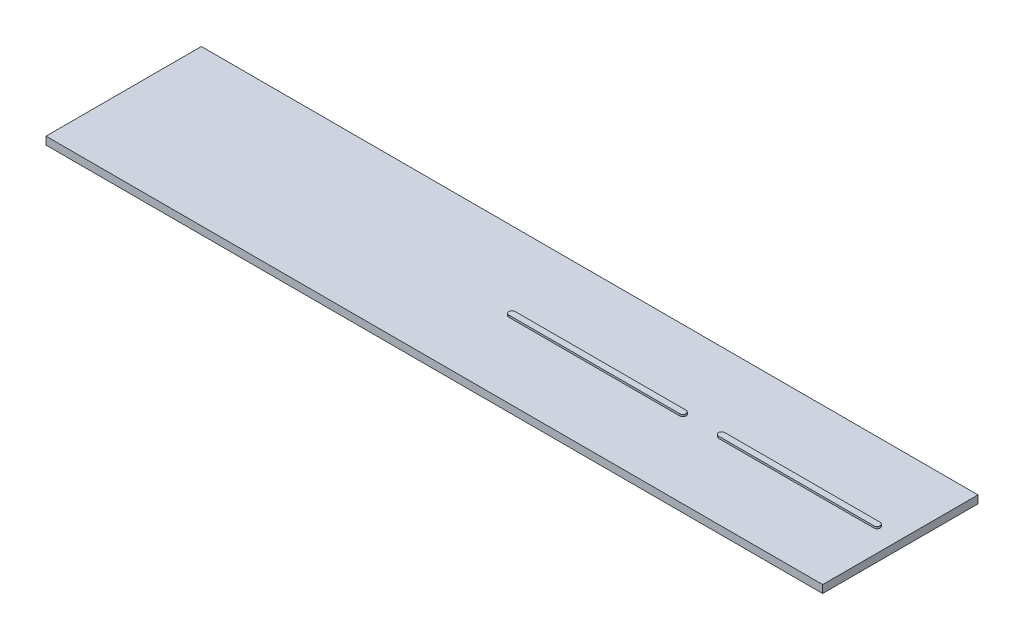
ISO-10303-21;
HEADER;
FILE_DESCRIPTION(('STEP AP214'),'2;1');
FILE_NAME('part.step','',(''),(''),'','','');
FILE_SCHEMA(('AUTOMOTIVE_DESIGN { 1 0 10303 214 1 1 1 1 }'));
ENDSEC;
DATA;
#1=APPLICATION_CONTEXT('core data for automotive mechanical design processes');
#2=APPLICATION_PROTOCOL_DEFINITION('international standard','automotive_design',2000,#1);
#3=PRODUCT_CONTEXT('',#1,'mechanical');
#4=PRODUCT('Part','Part','',(#3));
#5=PRODUCT_RELATED_PRODUCT_CATEGORY('part','',(#4));
#6=PRODUCT_DEFINITION_FORMATION('','',#4);
#7=PRODUCT_DEFINITION_CONTEXT('part definition',#1,'design');
#8=PRODUCT_DEFINITION('design','',#6,#7);
#9=PRODUCT_DEFINITION_SHAPE('','',#8);
#10=(LENGTH_UNIT() NAMED_UNIT(*) SI_UNIT(.MILLI.,.METRE.));
#11=(NAMED_UNIT(*) PLANE_ANGLE_UNIT() SI_UNIT($,.RADIAN.));
#12=(NAMED_UNIT(*) SI_UNIT($,.STERADIAN.) SOLID_ANGLE_UNIT());
#13=UNCERTAINTY_MEASURE_WITH_UNIT(LENGTH_MEASURE(1.E-05),#10,'distance_accuracy_value','');
#14=(GEOMETRIC_REPRESENTATION_CONTEXT(3) GLOBAL_UNCERTAINTY_ASSIGNED_CONTEXT((#13)) GLOBAL_UNIT_ASSIGNED_CONTEXT((#10,
#11,#12)) REPRESENTATION_CONTEXT('',''));
#15=CARTESIAN_POINT('',(0.,0.,0.));
#16=DIRECTION('',(0.,0.,1.));
#17=DIRECTION('',(1.,0.,0.));
#18=AXIS2_PLACEMENT_3D('',#15,#16,#17);
#19=CARTESIAN_POINT('',(0.,0.,0.));
#20=DIRECTION('',(0.,1.,0.));
#21=DIRECTION('',(0.,0.,1.));
#22=AXIS2_PLACEMENT_3D('',#19,#20,#21);
#23=PLANE('',#22);
#24=DIRECTION('',(0.,0.,1.));
#25=VECTOR('',#24,1.);
#26=CARTESIAN_POINT('',(-50000.,0.,-10000.));
#27=LINE('',#26,#25);
#28=CARTESIAN_POINT('',(-50000.,0.,-10000.));
#29=VERTEX_POINT('',#28);
#30=CARTESIAN_POINT('',(-50000.,0.,10000.));
#31=VERTEX_POINT('',#30);
#32=EDGE_CURVE('E203',#29,#31,#27,.T.);
#33=ORIENTED_EDGE('',*,*,#32,.T.);
#34=DIRECTION('',(1.,0.,0.));
#35=VECTOR('',#34,1.);
#36=CARTESIAN_POINT('',(-50000.,0.,10000.));
#37=LINE('',#36,#35);
#38=CARTESIAN_POINT('',(50000.,0.,10000.));
#39=VERTEX_POINT('',#38);
#40=EDGE_CURVE('E224',#31,#39,#37,.T.);
#41=ORIENTED_EDGE('',*,*,#40,.T.);
#42=DIRECTION('',(0.,0.,-1.));
#43=VECTOR('',#42,1.);
#44=CARTESIAN_POINT('',(50000.,0.,-10000.));
#45=LINE('',#44,#43);
#46=CARTESIAN_POINT('',(50000.,0.,-10000.));
#47=VERTEX_POINT('',#46);
#48=EDGE_CURVE('E228',#39,#47,#45,.T.);
#49=ORIENTED_EDGE('',*,*,#48,.T.);
#50=DIRECTION('',(-1.,0.,0.));
#51=VECTOR('',#50,1.);
#52=CARTESIAN_POINT('',(-50000.,0.,-10000.));
#53=LINE('',#52,#51);
#54=EDGE_CURVE('E209',#47,#29,#53,.T.);
#55=ORIENTED_EDGE('',*,*,#54,.T.);
#56=EDGE_LOOP('',(#33,#41,#49,#55));
#57=FACE_BOUND('',#56,.T.);
#58=DIRECTION('',(-1.,0.,0.));
#59=VECTOR('',#58,1.);
#60=CARTESIAN_POINT('',(47000.,0.,-400.));
#61=LINE('',#60,#59);
#62=CARTESIAN_POINT('',(47000.,0.,-400.));
#63=VERTEX_POINT('',#62);
#64=CARTESIAN_POINT('',(27000.,0.,-399.999999999997));
#65=VERTEX_POINT('',#64);
#66=EDGE_CURVE('E164',#63,#65,#61,.T.);
#67=ORIENTED_EDGE('',*,*,#66,.F.);
#68=CARTESIAN_POINT('',(47000.,0.,1.11022302462516E-13));
#69=DIRECTION('',(0.,1.,0.));
#70=DIRECTION('',(0.,0.,1.));
#71=AXIS2_PLACEMENT_3D('',#68,#69,#70);
#72=CIRCLE('',#71,400.);
#73=CARTESIAN_POINT('',(47000.,0.,400.));
#74=VERTEX_POINT('',#73);
#75=EDGE_CURVE('E159',#74,#63,#72,.T.);
#76=ORIENTED_EDGE('',*,*,#75,.F.);
#77=DIRECTION('',(1.,0.,0.));
#78=VECTOR('',#77,1.);
#79=CARTESIAN_POINT('',(47000.,0.,400.));
#80=LINE('',#79,#78);
#81=CARTESIAN_POINT('',(27000.,0.,400.000000000003));
#82=VERTEX_POINT('',#81);
#83=EDGE_CURVE('E174',#82,#74,#80,.T.);
#84=ORIENTED_EDGE('',*,*,#83,.F.);
#85=CARTESIAN_POINT('',(27000.,0.,2.5661396353745E-12));
#86=DIRECTION('',(0.,1.,0.));
#87=DIRECTION('',(0.,0.,1.));
#88=AXIS2_PLACEMENT_3D('',#85,#86,#87);
#89=CIRCLE('',#88,400.);
#90=EDGE_CURVE('E186',#65,#82,#89,.T.);
#91=ORIENTED_EDGE('',*,*,#90,.F.);
#92=EDGE_LOOP('',(#67,#76,#84,#91));
#93=FACE_BOUND('',#92,.T.);
#94=DIRECTION('',(1.,0.,0.));
#95=VECTOR('',#94,1.);
#96=CARTESIAN_POINT('',(0.,0.,400.));
#97=LINE('',#96,#95);
#98=CARTESIAN_POINT('',(0.,0.,400.));
#99=VERTEX_POINT('',#98);
#100=CARTESIAN_POINT('',(22000.,0.,400.));
#101=VERTEX_POINT('',#100);
#102=EDGE_CURVE('E405',#99,#101,#97,.T.);
#103=ORIENTED_EDGE('',*,*,#102,.F.);
#104=CARTESIAN_POINT('',(0.,0.,0.));
#105=DIRECTION('',(0.,1.,0.));
#106=DIRECTION('',(0.,0.,1.));
#107=AXIS2_PLACEMENT_3D('',#104,#105,#106);
#108=CIRCLE('',#107,400.);
#109=CARTESIAN_POINT('',(0.,0.,-400.));
#110=VERTEX_POINT('',#109);
#111=EDGE_CURVE('E156',#110,#99,#108,.T.);
#112=ORIENTED_EDGE('',*,*,#111,.F.);
#113=DIRECTION('',(-1.,0.,0.));
#114=VECTOR('',#113,1.);
#115=CARTESIAN_POINT('',(0.,0.,-400.));
#116=LINE('',#115,#114);
#117=CARTESIAN_POINT('',(22000.,0.,-400.));
#118=VERTEX_POINT('',#117);
#119=EDGE_CURVE('E152',#118,#110,#116,.T.);
#120=ORIENTED_EDGE('',*,*,#119,.F.);
#121=CARTESIAN_POINT('',(22000.,0.,0.));
#122=DIRECTION('',(0.,1.,0.));
#123=DIRECTION('',(0.,0.,1.));
#124=AXIS2_PLACEMENT_3D('',#121,#122,#123);
#125=CIRCLE('',#124,400.);
#126=EDGE_CURVE('E401',#101,#118,#125,.T.);
#127=ORIENTED_EDGE('',*,*,#126,.F.);
#128=EDGE_LOOP('',(#103,#112,#120,#127));
#129=FACE_BOUND('',#128,.T.);
#130=ADVANCED_FACE('F39',(#57,#93,#129),#23,.T.);
#131=CARTESIAN_POINT('',(-50000.,-1000.,-10000.));
#132=DIRECTION('',(-1.,0.,0.));
#133=DIRECTION('',(0.,0.,1.));
#134=AXIS2_PLACEMENT_3D('',#131,#132,#133);
#135=PLANE('',#134);
#136=ORIENTED_EDGE('',*,*,#32,.F.);
#137=DIRECTION('',(0.,1.,0.));
#138=VECTOR('',#137,1.);
#139=CARTESIAN_POINT('',(-50000.,-1000.,-10000.));
#140=LINE('',#139,#138);
#141=CARTESIAN_POINT('',(-50000.,-1000.,-10000.));
#142=VERTEX_POINT('',#141);
#143=EDGE_CURVE('E11',#142,#29,#140,.T.);
#144=ORIENTED_EDGE('',*,*,#143,.F.);
#145=DIRECTION('',(0.,0.,1.));
#146=VECTOR('',#145,1.);
#147=CARTESIAN_POINT('',(-50000.,-1000.,-10000.));
#148=LINE('',#147,#146);
#149=CARTESIAN_POINT('',(-50000.,-1000.,10000.));
#150=VERTEX_POINT('',#149);
#151=EDGE_CURVE('E204',#142,#150,#148,.T.);
#152=ORIENTED_EDGE('',*,*,#151,.T.);
#153=DIRECTION('',(0.,1.,0.));
#154=VECTOR('',#153,1.);
#155=CARTESIAN_POINT('',(-50000.,-1000.,10000.));
#156=LINE('',#155,#154);
#157=EDGE_CURVE('E43',#150,#31,#156,.T.);
#158=ORIENTED_EDGE('',*,*,#157,.T.);
#159=EDGE_LOOP('',(#136,#144,#152,#158));
#160=FACE_BOUND('',#159,.T.);
#161=ADVANCED_FACE('F41',(#160),#135,.T.);
#162=CARTESIAN_POINT('',(-50000.,-1000.,-10000.));
#163=DIRECTION('',(0.,0.,-1.));
#164=DIRECTION('',(-1.,0.,0.));
#165=AXIS2_PLACEMENT_3D('',#162,#163,#164);
#166=PLANE('',#165);
#167=ORIENTED_EDGE('',*,*,#54,.F.);
#168=DIRECTION('',(0.,1.,0.));
#169=VECTOR('',#168,1.);
#170=CARTESIAN_POINT('',(50000.,-1000.,-10000.));
#171=LINE('',#170,#169);
#172=CARTESIAN_POINT('',(50000.,-1000.,-10000.));
#173=VERTEX_POINT('',#172);
#174=EDGE_CURVE('E49',#173,#47,#171,.T.);
#175=ORIENTED_EDGE('',*,*,#174,.F.);
#176=DIRECTION('',(-1.,0.,0.));
#177=VECTOR('',#176,1.);
#178=CARTESIAN_POINT('',(-50000.,-1000.,-10000.));
#179=LINE('',#178,#177);
#180=EDGE_CURVE('E217',#173,#142,#179,.T.);
#181=ORIENTED_EDGE('',*,*,#180,.T.);
#182=ORIENTED_EDGE('',*,*,#143,.T.);
#183=EDGE_LOOP('',(#167,#175,#181,#182));
#184=FACE_BOUND('',#183,.T.);
#185=ADVANCED_FACE('F251',(#184),#166,.T.);
#186=CARTESIAN_POINT('',(50000.,-1000.,-10000.));
#187=DIRECTION('',(1.,0.,0.));
#188=DIRECTION('',(0.,0.,-1.));
#189=AXIS2_PLACEMENT_3D('',#186,#187,#188);
#190=PLANE('',#189);
#191=ORIENTED_EDGE('',*,*,#48,.F.);
#192=DIRECTION('',(0.,1.,0.));
#193=VECTOR('',#192,1.);
#194=CARTESIAN_POINT('',(50000.,-1000.,10000.));
#195=LINE('',#194,#193);
#196=CARTESIAN_POINT('',(50000.,-1000.,10000.));
#197=VERTEX_POINT('',#196);
#198=EDGE_CURVE('E236',#197,#39,#195,.T.);
#199=ORIENTED_EDGE('',*,*,#198,.F.);
#200=DIRECTION('',(0.,0.,-1.));
#201=VECTOR('',#200,1.);
#202=CARTESIAN_POINT('',(50000.,-1000.,-10000.));
#203=LINE('',#202,#201);
#204=EDGE_CURVE('E213',#197,#173,#203,.T.);
#205=ORIENTED_EDGE('',*,*,#204,.T.);
#206=ORIENTED_EDGE('',*,*,#174,.T.);
#207=EDGE_LOOP('',(#191,#199,#205,#206));
#208=FACE_BOUND('',#207,.T.);
#209=ADVANCED_FACE('F257',(#208),#190,.T.);
#210=CARTESIAN_POINT('',(-50000.,-1000.,10000.));
#211=DIRECTION('',(0.,0.,1.));
#212=DIRECTION('',(1.,0.,0.));
#213=AXIS2_PLACEMENT_3D('',#210,#211,#212);
#214=PLANE('',#213);
#215=ORIENTED_EDGE('',*,*,#40,.F.);
#216=ORIENTED_EDGE('',*,*,#157,.F.);
#217=DIRECTION('',(1.,0.,0.));
#218=VECTOR('',#217,1.);
#219=CARTESIAN_POINT('',(-50000.,-1000.,10000.));
#220=LINE('',#219,#218);
#221=EDGE_CURVE('E208',#150,#197,#220,.T.);
#222=ORIENTED_EDGE('',*,*,#221,.T.);
#223=ORIENTED_EDGE('',*,*,#198,.T.);
#224=EDGE_LOOP('',(#215,#216,#222,#223));
#225=FACE_BOUND('',#224,.T.);
#226=ADVANCED_FACE('F246',(#225),#214,.T.);
#227=CARTESIAN_POINT('',(0.,-1000.,0.));
#228=DIRECTION('',(0.,1.,0.));
#229=DIRECTION('',(0.,0.,1.));
#230=AXIS2_PLACEMENT_3D('',#227,#228,#229);
#231=PLANE('',#230);
#232=ORIENTED_EDGE('',*,*,#151,.F.);
#233=ORIENTED_EDGE('',*,*,#180,.F.);
#234=ORIENTED_EDGE('',*,*,#204,.F.);
#235=ORIENTED_EDGE('',*,*,#221,.F.);
#236=EDGE_LOOP('',(#232,#233,#234,#235));
#237=FACE_BOUND('',#236,.T.);
#238=ADVANCED_FACE('F254',(#237),#231,.F.);
#239=CARTESIAN_POINT('',(47000.,250.,1.11022302462516E-13));
#240=DIRECTION('',(0.,-1.,0.));
#241=DIRECTION('',(0.,0.,-1.));
#242=AXIS2_PLACEMENT_3D('',#239,#240,#241);
#243=CYLINDRICAL_SURFACE('',#242,400.);
#244=ORIENTED_EDGE('',*,*,#75,.T.);
#245=DIRECTION('',(0.,-1.,0.));
#246=VECTOR('',#245,1.);
#247=CARTESIAN_POINT('',(47000.,250.,-400.));
#248=LINE('',#247,#246);
#249=CARTESIAN_POINT('',(47000.,250.,-400.));
#250=VERTEX_POINT('',#249);
#251=EDGE_CURVE('E200',#250,#63,#248,.T.);
#252=ORIENTED_EDGE('',*,*,#251,.F.);
#253=CARTESIAN_POINT('',(47000.,250.,1.11022302462516E-13));
#254=DIRECTION('',(0.,1.,0.));
#255=DIRECTION('',(0.,0.,1.));
#256=AXIS2_PLACEMENT_3D('',#253,#254,#255);
#257=CIRCLE('',#256,400.);
#258=CARTESIAN_POINT('',(47000.,250.,400.));
#259=VERTEX_POINT('',#258);
#260=EDGE_CURVE('E169',#259,#250,#257,.T.);
#261=ORIENTED_EDGE('',*,*,#260,.F.);
#262=DIRECTION('',(0.,-1.,0.));
#263=VECTOR('',#262,1.);
#264=CARTESIAN_POINT('',(47000.,250.,400.));
#265=LINE('',#264,#263);
#266=EDGE_CURVE('E182',#259,#74,#265,.T.);
#267=ORIENTED_EDGE('',*,*,#266,.T.);
#268=EDGE_LOOP('',(#244,#252,#261,#267));
#269=FACE_BOUND('',#268,.T.);
#270=ADVANCED_FACE('F275',(#269),#243,.T.);
#271=CARTESIAN_POINT('',(47000.,250.,-400.));
#272=DIRECTION('',(0.,0.,1.));
#273=DIRECTION('',(1.,0.,0.));
#274=AXIS2_PLACEMENT_3D('',#271,#272,#273);
#275=PLANE('',#274);
#276=ORIENTED_EDGE('',*,*,#66,.T.);
#277=DIRECTION('',(0.,-1.,0.));
#278=VECTOR('',#277,1.);
#279=CARTESIAN_POINT('',(27000.,250.,-399.999999999997));
#280=LINE('',#279,#278);
#281=CARTESIAN_POINT('',(27000.,250.,-399.999999999997));
#282=VERTEX_POINT('',#281);
#283=EDGE_CURVE('E196',#282,#65,#280,.T.);
#284=ORIENTED_EDGE('',*,*,#283,.F.);
#285=DIRECTION('',(-1.,0.,0.));
#286=VECTOR('',#285,1.);
#287=CARTESIAN_POINT('',(47000.,250.,-400.));
#288=LINE('',#287,#286);
#289=EDGE_CURVE('E173',#250,#282,#288,.T.);
#290=ORIENTED_EDGE('',*,*,#289,.F.);
#291=ORIENTED_EDGE('',*,*,#251,.T.);
#292=EDGE_LOOP('',(#276,#284,#290,#291));
#293=FACE_BOUND('',#292,.T.);
#294=ADVANCED_FACE('F278',(#293),#275,.F.);
#295=CARTESIAN_POINT('',(27000.,250.,2.5661396353745E-12));
#296=DIRECTION('',(0.,-1.,0.));
#297=DIRECTION('',(0.,0.,-1.));
#298=AXIS2_PLACEMENT_3D('',#295,#296,#297);
#299=CYLINDRICAL_SURFACE('',#298,400.);
#300=ORIENTED_EDGE('',*,*,#90,.T.);
#301=DIRECTION('',(0.,-1.,0.));
#302=VECTOR('',#301,1.);
#303=CARTESIAN_POINT('',(27000.,250.,400.000000000003));
#304=LINE('',#303,#302);
#305=CARTESIAN_POINT('',(27000.,250.,400.000000000003));
#306=VERTEX_POINT('',#305);
#307=EDGE_CURVE('E65',#306,#82,#304,.T.);
#308=ORIENTED_EDGE('',*,*,#307,.F.);
#309=CARTESIAN_POINT('',(27000.,250.,2.5661396353745E-12));
#310=DIRECTION('',(0.,1.,0.));
#311=DIRECTION('',(0.,0.,1.));
#312=AXIS2_PLACEMENT_3D('',#309,#310,#311);
#313=CIRCLE('',#312,400.);
#314=EDGE_CURVE('E177',#282,#306,#313,.T.);
#315=ORIENTED_EDGE('',*,*,#314,.F.);
#316=ORIENTED_EDGE('',*,*,#283,.T.);
#317=EDGE_LOOP('',(#300,#308,#315,#316));
#318=FACE_BOUND('',#317,.T.);
#319=ADVANCED_FACE('F282',(#318),#299,.T.);
#320=CARTESIAN_POINT('',(47000.,250.,400.));
#321=DIRECTION('',(0.,0.,-1.));
#322=DIRECTION('',(-1.,0.,0.));
#323=AXIS2_PLACEMENT_3D('',#320,#321,#322);
#324=PLANE('',#323);
#325=ORIENTED_EDGE('',*,*,#83,.T.);
#326=ORIENTED_EDGE('',*,*,#266,.F.);
#327=DIRECTION('',(1.,0.,0.));
#328=VECTOR('',#327,1.);
#329=CARTESIAN_POINT('',(47000.,250.,400.));
#330=LINE('',#329,#328);
#331=EDGE_CURVE('E180',#306,#259,#330,.T.);
#332=ORIENTED_EDGE('',*,*,#331,.F.);
#333=ORIENTED_EDGE('',*,*,#307,.T.);
#334=EDGE_LOOP('',(#325,#326,#332,#333));
#335=FACE_BOUND('',#334,.T.);
#336=ADVANCED_FACE('F286',(#335),#324,.F.);
#337=CARTESIAN_POINT('',(47000.,250.,1.11022302462516E-13));
#338=DIRECTION('',(0.,1.,0.));
#339=DIRECTION('',(0.,0.,1.));
#340=AXIS2_PLACEMENT_3D('',#337,#338,#339);
#341=PLANE('',#340);
#342=ORIENTED_EDGE('',*,*,#260,.T.);
#343=ORIENTED_EDGE('',*,*,#289,.T.);
#344=ORIENTED_EDGE('',*,*,#314,.T.);
#345=ORIENTED_EDGE('',*,*,#331,.T.);
#346=EDGE_LOOP('',(#342,#343,#344,#345));
#347=FACE_BOUND('',#346,.T.);
#348=ADVANCED_FACE('F290',(#347),#341,.T.);
#349=CARTESIAN_POINT('',(0.,250.,0.));
#350=DIRECTION('',(0.,-1.,0.));
#351=DIRECTION('',(0.,0.,-1.));
#352=AXIS2_PLACEMENT_3D('',#349,#350,#351);
#353=CYLINDRICAL_SURFACE('',#352,400.);
#354=ORIENTED_EDGE('',*,*,#111,.T.);
#355=DIRECTION('',(0.,-1.,0.));
#356=VECTOR('',#355,1.);
#357=CARTESIAN_POINT('',(0.,250.,400.));
#358=LINE('',#357,#356);
#359=CARTESIAN_POINT('',(0.,250.,400.));
#360=VERTEX_POINT('',#359);
#361=EDGE_CURVE('E135',#360,#99,#358,.T.);
#362=ORIENTED_EDGE('',*,*,#361,.F.);
#363=CARTESIAN_POINT('',(0.,250.,0.));
#364=DIRECTION('',(0.,1.,0.));
#365=DIRECTION('',(0.,0.,1.));
#366=AXIS2_PLACEMENT_3D('',#363,#364,#365);
#367=CIRCLE('',#366,400.);
#368=CARTESIAN_POINT('',(0.,250.,-400.));
#369=VERTEX_POINT('',#368);
#370=EDGE_CURVE('E143',#369,#360,#367,.T.);
#371=ORIENTED_EDGE('',*,*,#370,.F.);
#372=DIRECTION('',(0.,-1.,0.));
#373=VECTOR('',#372,1.);
#374=CARTESIAN_POINT('',(0.,250.,-400.));
#375=LINE('',#374,#373);
#376=EDGE_CURVE('E397',#369,#110,#375,.T.);
#377=ORIENTED_EDGE('',*,*,#376,.T.);
#378=EDGE_LOOP('',(#354,#362,#371,#377));
#379=FACE_BOUND('',#378,.T.);
#380=ADVANCED_FACE('F154',(#379),#353,.T.);
#381=CARTESIAN_POINT('',(0.,250.,400.));
#382=DIRECTION('',(0.,0.,-1.));
#383=DIRECTION('',(-1.,0.,0.));
#384=AXIS2_PLACEMENT_3D('',#381,#382,#383);
#385=PLANE('',#384);
#386=ORIENTED_EDGE('',*,*,#102,.T.);
#387=DIRECTION('',(0.,-1.,0.));
#388=VECTOR('',#387,1.);
#389=CARTESIAN_POINT('',(22000.,250.,400.));
#390=LINE('',#389,#388);
#391=CARTESIAN_POINT('',(22000.,250.,400.));
#392=VERTEX_POINT('',#391);
#393=EDGE_CURVE('E138',#392,#101,#390,.T.);
#394=ORIENTED_EDGE('',*,*,#393,.F.);
#395=DIRECTION('',(1.,0.,0.));
#396=VECTOR('',#395,1.);
#397=CARTESIAN_POINT('',(0.,250.,400.));
#398=LINE('',#397,#396);
#399=EDGE_CURVE('E131',#360,#392,#398,.T.);
#400=ORIENTED_EDGE('',*,*,#399,.F.);
#401=ORIENTED_EDGE('',*,*,#361,.T.);
#402=EDGE_LOOP('',(#386,#394,#400,#401));
#403=FACE_BOUND('',#402,.T.);
#404=ADVANCED_FACE('F133',(#403),#385,.F.);
#405=CARTESIAN_POINT('',(22000.,250.,0.));
#406=DIRECTION('',(0.,-1.,0.));
#407=DIRECTION('',(0.,0.,-1.));
#408=AXIS2_PLACEMENT_3D('',#405,#406,#407);
#409=CYLINDRICAL_SURFACE('',#408,400.);
#410=ORIENTED_EDGE('',*,*,#126,.T.);
#411=DIRECTION('',(0.,-1.,0.));
#412=VECTOR('',#411,1.);
#413=CARTESIAN_POINT('',(22000.,250.,-400.));
#414=LINE('',#413,#412);
#415=CARTESIAN_POINT('',(22000.,250.,-400.));
#416=VERTEX_POINT('',#415);
#417=EDGE_CURVE('E57',#416,#118,#414,.T.);
#418=ORIENTED_EDGE('',*,*,#417,.F.);
#419=CARTESIAN_POINT('',(22000.,250.,0.));
#420=DIRECTION('',(0.,1.,0.));
#421=DIRECTION('',(0.,0.,1.));
#422=AXIS2_PLACEMENT_3D('',#419,#420,#421);
#423=CIRCLE('',#422,400.);
#424=EDGE_CURVE('E142',#392,#416,#423,.T.);
#425=ORIENTED_EDGE('',*,*,#424,.F.);
#426=ORIENTED_EDGE('',*,*,#393,.T.);
#427=EDGE_LOOP('',(#410,#418,#425,#426));
#428=FACE_BOUND('',#427,.T.);
#429=ADVANCED_FACE('F298',(#428),#409,.T.);
#430=CARTESIAN_POINT('',(0.,250.,-400.));
#431=DIRECTION('',(0.,0.,1.));
#432=DIRECTION('',(1.,0.,0.));
#433=AXIS2_PLACEMENT_3D('',#430,#431,#432);
#434=PLANE('',#433);
#435=ORIENTED_EDGE('',*,*,#119,.T.);
#436=ORIENTED_EDGE('',*,*,#376,.F.);
#437=DIRECTION('',(-1.,0.,0.));
#438=VECTOR('',#437,1.);
#439=CARTESIAN_POINT('',(0.,250.,-400.));
#440=LINE('',#439,#438);
#441=EDGE_CURVE('E147',#416,#369,#440,.T.);
#442=ORIENTED_EDGE('',*,*,#441,.F.);
#443=ORIENTED_EDGE('',*,*,#417,.T.);
#444=EDGE_LOOP('',(#435,#436,#442,#443));
#445=FACE_BOUND('',#444,.T.);
#446=ADVANCED_FACE('F301',(#445),#434,.F.);
#447=CARTESIAN_POINT('',(0.,250.,0.));
#448=DIRECTION('',(0.,1.,0.));
#449=DIRECTION('',(0.,0.,1.));
#450=AXIS2_PLACEMENT_3D('',#447,#448,#449);
#451=PLANE('',#450);
#452=ORIENTED_EDGE('',*,*,#370,.T.);
#453=ORIENTED_EDGE('',*,*,#399,.T.);
#454=ORIENTED_EDGE('',*,*,#424,.T.);
#455=ORIENTED_EDGE('',*,*,#441,.T.);
#456=EDGE_LOOP('',(#452,#453,#454,#455));
#457=FACE_BOUND('',#456,.T.);
#458=ADVANCED_FACE('F146',(#457),#451,.T.);
#459=CLOSED_SHELL('',(#130,#161,#185,#209,#226,#238,#270,#294,#319,#336,#348,#380,#404,#429,
#446,#458));
#460=MANIFOLD_SOLID_BREP('B2',#459);
#461=ADVANCED_BREP_SHAPE_REPRESENTATION('',(#18,#460),#14);
#462=SHAPE_DEFINITION_REPRESENTATION(#9,#461);
ENDSEC;
END-ISO-10303-21;
